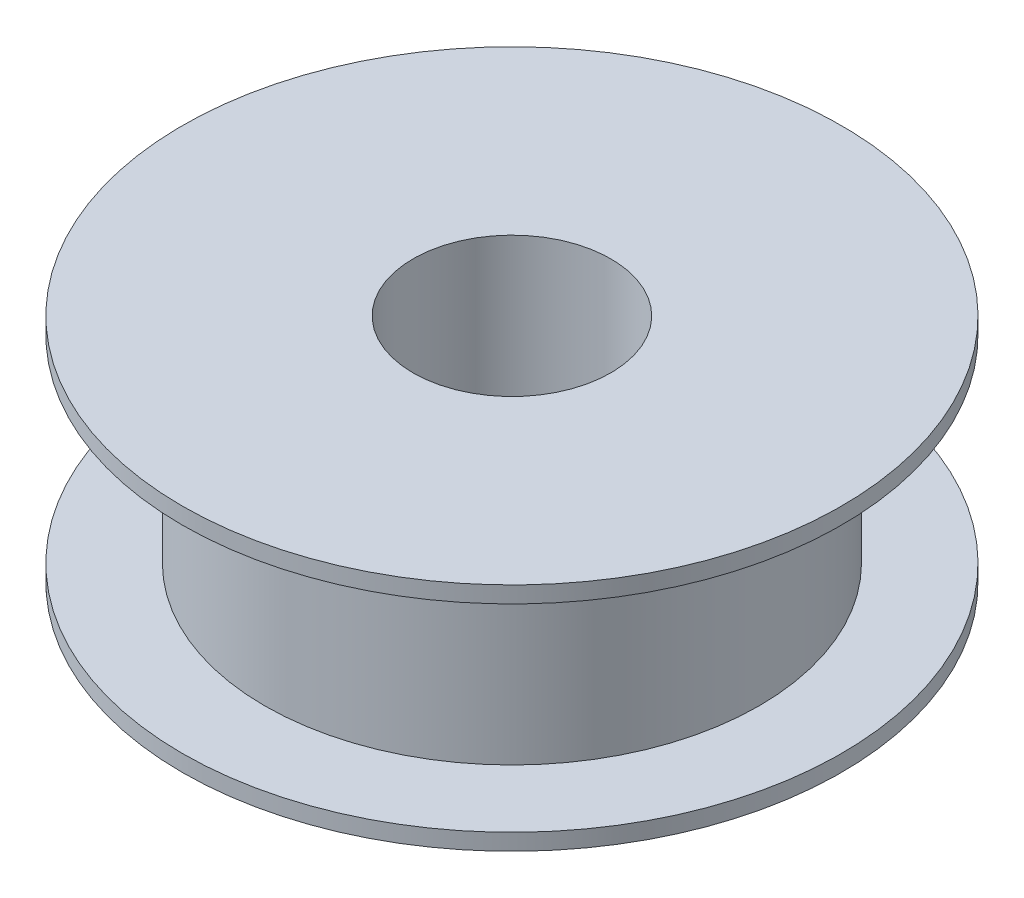
ISO-10303-21;
HEADER;
FILE_DESCRIPTION(('STEP AP214'),'2;1');
FILE_NAME('part.step','',(''),(''),'','','');
FILE_SCHEMA(('AUTOMOTIVE_DESIGN { 1 0 10303 214 1 1 1 1 }'));
ENDSEC;
DATA;
#1=APPLICATION_CONTEXT('core data for automotive mechanical design processes');
#2=APPLICATION_PROTOCOL_DEFINITION('international standard','automotive_design',2000,#1);
#3=PRODUCT_CONTEXT('',#1,'mechanical');
#4=PRODUCT('Part','Part','',(#3));
#5=PRODUCT_RELATED_PRODUCT_CATEGORY('part','',(#4));
#6=PRODUCT_DEFINITION_FORMATION('','',#4);
#7=PRODUCT_DEFINITION_CONTEXT('part definition',#1,'design');
#8=PRODUCT_DEFINITION('design','',#6,#7);
#9=PRODUCT_DEFINITION_SHAPE('','',#8);
#10=(LENGTH_UNIT() NAMED_UNIT(*) SI_UNIT(.MILLI.,.METRE.));
#11=(NAMED_UNIT(*) PLANE_ANGLE_UNIT() SI_UNIT($,.RADIAN.));
#12=(NAMED_UNIT(*) SI_UNIT($,.STERADIAN.) SOLID_ANGLE_UNIT());
#13=UNCERTAINTY_MEASURE_WITH_UNIT(LENGTH_MEASURE(1.E-05),#10,'distance_accuracy_value','');
#14=(GEOMETRIC_REPRESENTATION_CONTEXT(3) GLOBAL_UNCERTAINTY_ASSIGNED_CONTEXT((#13)) GLOBAL_UNIT_ASSIGNED_CONTEXT((#10,
#11,#12)) REPRESENTATION_CONTEXT('',''));
#15=CARTESIAN_POINT('',(0.,0.,0.));
#16=DIRECTION('',(0.,0.,1.));
#17=DIRECTION('',(1.,0.,0.));
#18=AXIS2_PLACEMENT_3D('',#15,#16,#17);
#19=CARTESIAN_POINT('',(0.,0.,0.));
#20=DIRECTION('',(0.,1.,0.));
#21=DIRECTION('',(0.,0.,1.));
#22=AXIS2_PLACEMENT_3D('',#19,#20,#21);
#23=PLANE('',#22);
#24=CARTESIAN_POINT('',(0.,0.,0.));
#25=DIRECTION('',(0.,1.,0.));
#26=DIRECTION('',(0.,0.,1.));
#27=AXIS2_PLACEMENT_3D('',#24,#25,#26);
#28=CIRCLE('',#27,20.);
#29=CARTESIAN_POINT('',(0.,0.,20.));
#30=VERTEX_POINT('',#29);
#31=EDGE_CURVE('E34',#30,#30,#28,.T.);
#32=ORIENTED_EDGE('',*,*,#31,.T.);
#33=EDGE_LOOP('',(#32));
#34=FACE_BOUND('',#33,.T.);
#35=CARTESIAN_POINT('',(0.,0.,0.));
#36=DIRECTION('',(0.,1.,0.));
#37=DIRECTION('',(0.,0.,1.));
#38=AXIS2_PLACEMENT_3D('',#35,#36,#37);
#39=CIRCLE('',#38,15.);
#40=CARTESIAN_POINT('',(0.,0.,15.));
#41=VERTEX_POINT('',#40);
#42=EDGE_CURVE('E44',#41,#41,#39,.T.);
#43=ORIENTED_EDGE('',*,*,#42,.F.);
#44=EDGE_LOOP('',(#43));
#45=FACE_BOUND('',#44,.T.);
#46=ADVANCED_FACE('F30',(#34,#45),#23,.T.);
#47=CARTESIAN_POINT('',(0.,-1.,0.));
#48=DIRECTION('',(0.,1.,0.));
#49=DIRECTION('',(0.,0.,1.));
#50=AXIS2_PLACEMENT_3D('',#47,#48,#49);
#51=CYLINDRICAL_SURFACE('',#50,20.);
#52=CARTESIAN_POINT('',(0.,-1.,0.));
#53=DIRECTION('',(0.,1.,0.));
#54=DIRECTION('',(0.,0.,1.));
#55=AXIS2_PLACEMENT_3D('',#52,#53,#54);
#56=CIRCLE('',#55,20.);
#57=CARTESIAN_POINT('',(0.,-1.,20.));
#58=VERTEX_POINT('',#57);
#59=EDGE_CURVE('E38',#58,#58,#56,.T.);
#60=ORIENTED_EDGE('',*,*,#59,.T.);
#61=EDGE_LOOP('',(#60));
#62=FACE_BOUND('',#61,.T.);
#63=ORIENTED_EDGE('',*,*,#31,.F.);
#64=EDGE_LOOP('',(#63));
#65=FACE_BOUND('',#64,.T.);
#66=ADVANCED_FACE('F32',(#62,#65),#51,.T.);
#67=CARTESIAN_POINT('',(0.,-1.,0.));
#68=DIRECTION('',(0.,1.,0.));
#69=DIRECTION('',(0.,0.,1.));
#70=AXIS2_PLACEMENT_3D('',#67,#68,#69);
#71=CYLINDRICAL_SURFACE('',#70,6.);
#72=CARTESIAN_POINT('',(0.,-1.,0.));
#73=DIRECTION('',(0.,1.,0.));
#74=DIRECTION('',(0.,0.,1.));
#75=AXIS2_PLACEMENT_3D('',#72,#73,#74);
#76=CIRCLE('',#75,6.);
#77=CARTESIAN_POINT('',(0.,-1.,6.));
#78=VERTEX_POINT('',#77);
#79=EDGE_CURVE('E10',#78,#78,#76,.T.);
#80=ORIENTED_EDGE('',*,*,#79,.F.);
#81=EDGE_LOOP('',(#80));
#82=FACE_BOUND('',#81,.T.);
#83=CARTESIAN_POINT('',(0.,13.,0.));
#84=DIRECTION('',(0.,1.,0.));
#85=DIRECTION('',(0.,0.,1.));
#86=AXIS2_PLACEMENT_3D('',#83,#84,#85);
#87=CIRCLE('',#86,6.);
#88=CARTESIAN_POINT('',(0.,13.,6.));
#89=VERTEX_POINT('',#88);
#90=EDGE_CURVE('E54',#89,#89,#87,.F.);
#91=ORIENTED_EDGE('',*,*,#90,.F.);
#92=EDGE_LOOP('',(#91));
#93=FACE_BOUND('',#92,.T.);
#94=ADVANCED_FACE('F63',(#82,#93),#71,.F.);
#95=CARTESIAN_POINT('',(0.,-1.,0.));
#96=DIRECTION('',(0.,1.,0.));
#97=DIRECTION('',(0.,0.,1.));
#98=AXIS2_PLACEMENT_3D('',#95,#96,#97);
#99=PLANE('',#98);
#100=ORIENTED_EDGE('',*,*,#59,.F.);
#101=EDGE_LOOP('',(#100));
#102=FACE_BOUND('',#101,.T.);
#103=ORIENTED_EDGE('',*,*,#79,.T.);
#104=EDGE_LOOP('',(#103));
#105=FACE_BOUND('',#104,.T.);
#106=ADVANCED_FACE('F65',(#102,#105),#99,.F.);
#107=CARTESIAN_POINT('',(0.,12.,0.));
#108=DIRECTION('',(0.,-1.,0.));
#109=DIRECTION('',(0.,0.,-1.));
#110=AXIS2_PLACEMENT_3D('',#107,#108,#109);
#111=CYLINDRICAL_SURFACE('',#110,15.);
#112=CARTESIAN_POINT('',(0.,12.,0.));
#113=DIRECTION('',(0.,1.,0.));
#114=DIRECTION('',(0.,0.,1.));
#115=AXIS2_PLACEMENT_3D('',#112,#113,#114);
#116=CIRCLE('',#115,15.);
#117=CARTESIAN_POINT('',(0.,12.,15.));
#118=VERTEX_POINT('',#117);
#119=EDGE_CURVE('E47',#118,#118,#116,.T.);
#120=ORIENTED_EDGE('',*,*,#119,.F.);
#121=EDGE_LOOP('',(#120));
#122=FACE_BOUND('',#121,.T.);
#123=ORIENTED_EDGE('',*,*,#42,.T.);
#124=EDGE_LOOP('',(#123));
#125=FACE_BOUND('',#124,.T.);
#126=ADVANCED_FACE('F71',(#122,#125),#111,.T.);
#127=CARTESIAN_POINT('',(0.,12.,0.));
#128=DIRECTION('',(0.,1.,0.));
#129=DIRECTION('',(0.,0.,1.));
#130=AXIS2_PLACEMENT_3D('',#127,#128,#129);
#131=PLANE('',#130);
#132=CARTESIAN_POINT('',(0.,12.,0.));
#133=DIRECTION('',(0.,1.,0.));
#134=DIRECTION('',(0.,0.,1.));
#135=AXIS2_PLACEMENT_3D('',#132,#133,#134);
#136=CIRCLE('',#135,20.);
#137=CARTESIAN_POINT('',(0.,12.,20.));
#138=VERTEX_POINT('',#137);
#139=EDGE_CURVE('E51',#138,#138,#136,.T.);
#140=ORIENTED_EDGE('',*,*,#139,.F.);
#141=EDGE_LOOP('',(#140));
#142=FACE_BOUND('',#141,.T.);
#143=ORIENTED_EDGE('',*,*,#119,.T.);
#144=EDGE_LOOP('',(#143));
#145=FACE_BOUND('',#144,.T.);
#146=ADVANCED_FACE('F85',(#142,#145),#131,.F.);
#147=CARTESIAN_POINT('',(0.,13.,0.));
#148=DIRECTION('',(0.,-1.,0.));
#149=DIRECTION('',(0.,0.,-1.));
#150=AXIS2_PLACEMENT_3D('',#147,#148,#149);
#151=CYLINDRICAL_SURFACE('',#150,20.);
#152=CARTESIAN_POINT('',(0.,13.,0.));
#153=DIRECTION('',(0.,1.,0.));
#154=DIRECTION('',(0.,0.,1.));
#155=AXIS2_PLACEMENT_3D('',#152,#153,#154);
#156=CIRCLE('',#155,20.);
#157=CARTESIAN_POINT('',(0.,13.,20.));
#158=VERTEX_POINT('',#157);
#159=EDGE_CURVE('E48',#158,#158,#156,.T.);
#160=ORIENTED_EDGE('',*,*,#159,.F.);
#161=EDGE_LOOP('',(#160));
#162=FACE_BOUND('',#161,.T.);
#163=ORIENTED_EDGE('',*,*,#139,.T.);
#164=EDGE_LOOP('',(#163));
#165=FACE_BOUND('',#164,.T.);
#166=ADVANCED_FACE('F87',(#162,#165),#151,.T.);
#167=CARTESIAN_POINT('',(0.,13.,0.));
#168=DIRECTION('',(0.,1.,0.));
#169=DIRECTION('',(0.,0.,1.));
#170=AXIS2_PLACEMENT_3D('',#167,#168,#169);
#171=PLANE('',#170);
#172=ORIENTED_EDGE('',*,*,#90,.T.);
#173=EDGE_LOOP('',(#172));
#174=FACE_BOUND('',#173,.T.);
#175=ORIENTED_EDGE('',*,*,#159,.T.);
#176=EDGE_LOOP('',(#175));
#177=FACE_BOUND('',#176,.T.);
#178=ADVANCED_FACE('F60',(#174,#177),#171,.T.);
#179=CLOSED_SHELL('',(#46,#66,#94,#106,#126,#146,#166,#178));
#180=MANIFOLD_SOLID_BREP('B2',#179);
#181=ADVANCED_BREP_SHAPE_REPRESENTATION('',(#18,#180),#14);
#182=SHAPE_DEFINITION_REPRESENTATION(#9,#181);
ENDSEC;
END-ISO-10303-21;
